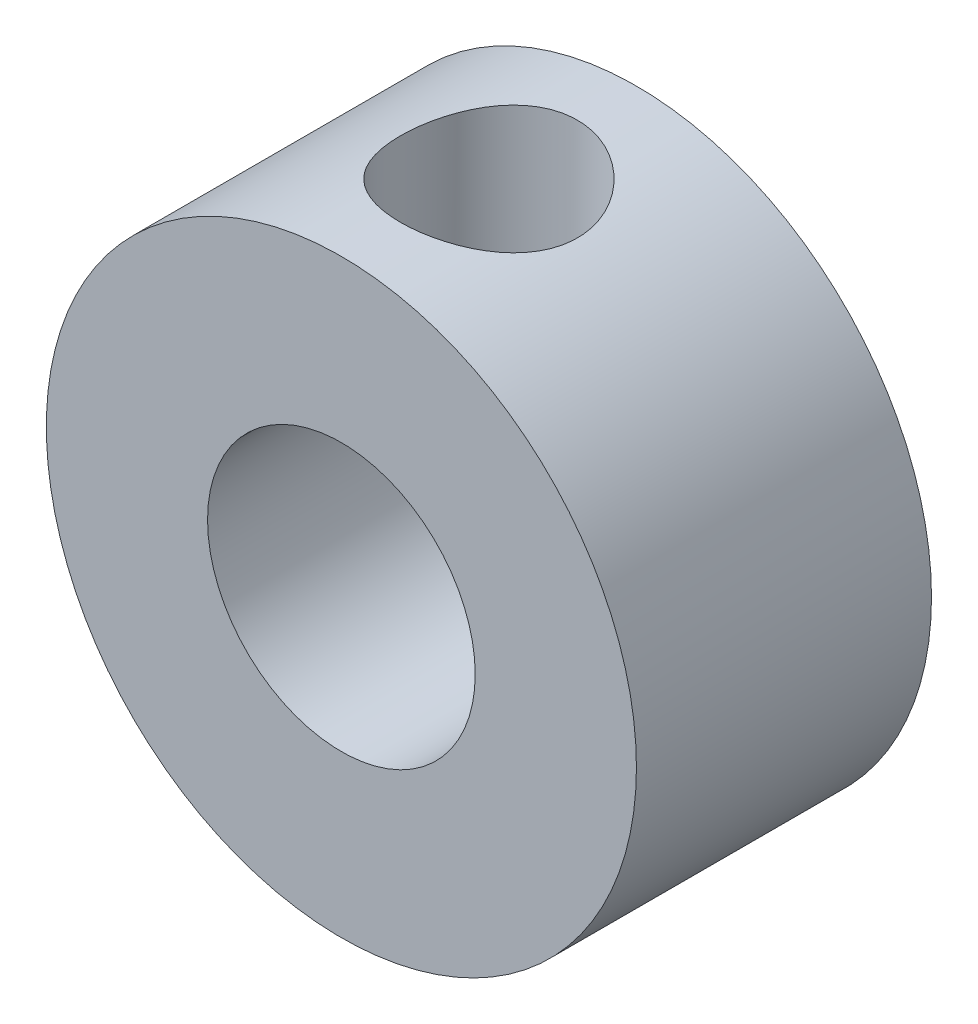
ISO-10303-21;
HEADER;
FILE_DESCRIPTION(('STEP AP214'),'2;1');
FILE_NAME('part.step','',(''),(''),'','','');
FILE_SCHEMA(('AUTOMOTIVE_DESIGN { 1 0 10303 214 1 1 1 1 }'));
ENDSEC;
DATA;
#1=APPLICATION_CONTEXT('core data for automotive mechanical design processes');
#2=APPLICATION_PROTOCOL_DEFINITION('international standard','automotive_design',2000,#1);
#3=PRODUCT_CONTEXT('',#1,'mechanical');
#4=PRODUCT('Part','Part','',(#3));
#5=PRODUCT_RELATED_PRODUCT_CATEGORY('part','',(#4));
#6=PRODUCT_DEFINITION_FORMATION('','',#4);
#7=PRODUCT_DEFINITION_CONTEXT('part definition',#1,'design');
#8=PRODUCT_DEFINITION('design','',#6,#7);
#9=PRODUCT_DEFINITION_SHAPE('','',#8);
#10=(LENGTH_UNIT() NAMED_UNIT(*) SI_UNIT(.MILLI.,.METRE.));
#11=(NAMED_UNIT(*) PLANE_ANGLE_UNIT() SI_UNIT($,.RADIAN.));
#12=(NAMED_UNIT(*) SI_UNIT($,.STERADIAN.) SOLID_ANGLE_UNIT());
#13=UNCERTAINTY_MEASURE_WITH_UNIT(LENGTH_MEASURE(1.E-05),#10,'distance_accuracy_value','');
#14=(GEOMETRIC_REPRESENTATION_CONTEXT(3) GLOBAL_UNCERTAINTY_ASSIGNED_CONTEXT((#13)) GLOBAL_UNIT_ASSIGNED_CONTEXT((#10,
#11,#12)) REPRESENTATION_CONTEXT('',''));
#15=CARTESIAN_POINT('',(0.,0.,0.));
#16=DIRECTION('',(0.,0.,1.));
#17=DIRECTION('',(1.,0.,0.));
#18=AXIS2_PLACEMENT_3D('',#15,#16,#17);
#19=CARTESIAN_POINT('',(0.,0.,7.));
#20=DIRECTION('',(0.,0.,1.));
#21=DIRECTION('',(1.,0.,0.));
#22=AXIS2_PLACEMENT_3D('',#19,#20,#21);
#23=PLANE('',#22);
#24=CARTESIAN_POINT('',(0.,0.,7.));
#25=DIRECTION('',(0.,0.,1.));
#26=DIRECTION('',(1.,0.,0.));
#27=AXIS2_PLACEMENT_3D('',#24,#25,#26);
#28=CIRCLE('',#27,7.);
#29=CARTESIAN_POINT('',(7.,0.,7.));
#30=VERTEX_POINT('',#29);
#31=EDGE_CURVE('E10',#30,#30,#28,.T.);
#32=ORIENTED_EDGE('',*,*,#31,.T.);
#33=EDGE_LOOP('',(#32));
#34=FACE_BOUND('',#33,.T.);
#35=CARTESIAN_POINT('',(0.,0.,7.));
#36=DIRECTION('',(0.,0.,1.));
#37=DIRECTION('',(1.,0.,0.));
#38=AXIS2_PLACEMENT_3D('',#35,#36,#37);
#39=CIRCLE('',#38,3.175);
#40=CARTESIAN_POINT('',(3.175,0.,7.));
#41=VERTEX_POINT('',#40);
#42=EDGE_CURVE('E47',#41,#41,#39,.T.);
#43=ORIENTED_EDGE('',*,*,#42,.F.);
#44=EDGE_LOOP('',(#43));
#45=FACE_BOUND('',#44,.T.);
#46=ADVANCED_FACE('F35',(#34,#45),#23,.T.);
#47=CARTESIAN_POINT('',(0.,0.,0.));
#48=DIRECTION('',(0.,0.,1.));
#49=DIRECTION('',(1.,0.,0.));
#50=AXIS2_PLACEMENT_3D('',#47,#48,#49);
#51=PLANE('',#50);
#52=CARTESIAN_POINT('',(0.,0.,0.));
#53=DIRECTION('',(0.,0.,1.));
#54=DIRECTION('',(1.,0.,0.));
#55=AXIS2_PLACEMENT_3D('',#52,#53,#54);
#56=CIRCLE('',#55,7.);
#57=CARTESIAN_POINT('',(7.,0.,0.));
#58=VERTEX_POINT('',#57);
#59=EDGE_CURVE('E40',#58,#58,#56,.T.);
#60=ORIENTED_EDGE('',*,*,#59,.F.);
#61=EDGE_LOOP('',(#60));
#62=FACE_BOUND('',#61,.T.);
#63=CARTESIAN_POINT('',(0.,0.,0.));
#64=DIRECTION('',(0.,0.,1.));
#65=DIRECTION('',(1.,0.,0.));
#66=AXIS2_PLACEMENT_3D('',#63,#64,#65);
#67=CIRCLE('',#66,3.175);
#68=CARTESIAN_POINT('',(3.175,0.,0.));
#69=VERTEX_POINT('',#68);
#70=EDGE_CURVE('E49',#69,#69,#67,.T.);
#71=ORIENTED_EDGE('',*,*,#70,.T.);
#72=EDGE_LOOP('',(#71));
#73=FACE_BOUND('',#72,.T.);
#74=ADVANCED_FACE('F76',(#62,#73),#51,.F.);
#75=CARTESIAN_POINT('',(0.,0.,7.));
#76=DIRECTION('',(0.,0.,-1.));
#77=DIRECTION('',(-1.,0.,0.));
#78=AXIS2_PLACEMENT_3D('',#75,#76,#77);
#79=CYLINDRICAL_SURFACE('',#78,7.);
#80=CARTESIAN_POINT('',(0.,7.,5.59999999999999));
#81=CARTESIAN_POINT('',(-0.115204057854619,6.9999990095077,5.59999860352115));
#82=CARTESIAN_POINT('',(-0.23042224569214,6.99712881971535,5.59048859092644));
#83=CARTESIAN_POINT('',(-0.457503375426832,6.98595947831167,5.55279010408905));
#84=CARTESIAN_POINT('',(-0.569365306175986,6.97765870745569,5.52459605876731));
#85=CARTESIAN_POINT('',(-0.786425790856335,6.95653773502571,5.45055557632562));
#86=CARTESIAN_POINT('',(-0.89163391015352,6.94372420350596,5.40473518253348));
#87=CARTESIAN_POINT('',(-1.09287385347438,6.91490952932704,5.29684946972182));
#88=CARTESIAN_POINT('',(-1.18890445445753,6.89890796268893,5.23478198964641));
#89=CARTESIAN_POINT('',(-1.37182051605724,6.86491032069884,5.09428638953826));
#90=CARTESIAN_POINT('',(-1.45840529974207,6.84687337119851,5.01547672375972));
#91=CARTESIAN_POINT('',(-1.61734889292653,6.81108167894619,4.84454707812574));
#92=CARTESIAN_POINT('',(-1.68970530858417,6.79332698414302,4.75242486302505));
#93=CARTESIAN_POINT('',(-1.8197205281319,6.75967759591281,4.55494094574734));
#94=CARTESIAN_POINT('',(-1.87701232631098,6.74383369329425,4.44932815461296));
#95=CARTESIAN_POINT('',(-1.97289952684664,6.71641068551644,4.22941504407759));
#96=CARTESIAN_POINT('',(-2.01149941887962,6.70483055638635,4.11511681850083));
#97=CARTESIAN_POINT('',(-2.06782287155712,6.68767219173808,3.88445362741736));
#98=CARTESIAN_POINT('',(-2.08610074728548,6.68193497054347,3.76823615859048));
#99=CARTESIAN_POINT('',(-2.1029922286054,6.67663905649674,3.53425358129653));
#100=CARTESIAN_POINT('',(-2.10161059865509,6.677078866648,3.41648885471728));
#101=CARTESIAN_POINT('',(-2.07965768079736,6.68394641694889,3.18726252794812));
#102=CARTESIAN_POINT('',(-2.05978087367759,6.69015744038797,3.07572684949287));
#103=CARTESIAN_POINT('',(-2.00252388597878,6.70751698720074,2.85765229921716));
#104=CARTESIAN_POINT('',(-1.96514197798297,6.71866599785291,2.75111392167594));
#105=CARTESIAN_POINT('',(-1.87342437315154,6.74481826304963,2.54435951047497));
#106=CARTESIAN_POINT('',(-1.81886343708499,6.75987222562333,2.44425008246264));
#107=CARTESIAN_POINT('',(-1.69449311624156,6.7921138180009,2.25437516918573));
#108=CARTESIAN_POINT('',(-1.62468003603623,6.80930196445788,2.16461219882071));
#109=CARTESIAN_POINT('',(-1.46833807071764,6.84475415817112,1.99403933293317));
#110=CARTESIAN_POINT('',(-1.38123287045376,6.86303316034697,1.91375987035847));
#111=CARTESIAN_POINT('',(-1.19456856303955,6.89797141688562,1.76882442231006));
#112=CARTESIAN_POINT('',(-1.09500867260524,6.91463056925774,1.70416942021981));
#113=CARTESIAN_POINT('',(-0.885297053679921,6.94460424097259,1.59199610854938));
#114=CARTESIAN_POINT('',(-0.775078849647127,6.9578956113564,1.5445954772502));
#115=CARTESIAN_POINT('',(-0.547743581844925,6.97946930565111,1.46916057386052));
#116=CARTESIAN_POINT('',(-0.430628452225412,6.98775302661799,1.44112090005452));
#117=CARTESIAN_POINT('',(-0.197333139735663,6.99815710500954,1.40608695094086));
#118=CARTESIAN_POINT('',(-0.0812701366416606,7.00048790584906,1.39837377987775));
#119=CARTESIAN_POINT('',(0.150499448152737,6.99934092538464,1.40219681799692));
#120=CARTESIAN_POINT('',(0.266206075367093,6.9958639194886,1.41373045751203));
#121=CARTESIAN_POINT('',(0.491265047433575,6.98362975782027,1.4551384555561));
#122=CARTESIAN_POINT('',(0.600701881659836,6.9749936171918,1.48459274261322));
#123=CARTESIAN_POINT('',(0.813056494536329,6.95344086978149,1.56050052588949));
#124=CARTESIAN_POINT('',(0.915973487835815,6.94052374849531,1.60695606545301));
#125=CARTESIAN_POINT('',(1.11501206524547,6.91137516091842,1.71675443167359));
#126=CARTESIAN_POINT('',(1.21092135667953,6.89507393161496,1.78046307732718));
#127=CARTESIAN_POINT('',(1.3909326311722,6.86102856270093,1.92251465567393));
#128=CARTESIAN_POINT('',(1.47503164529831,6.84328406203694,2.00086125664271));
#129=CARTESIAN_POINT('',(1.63220042371436,6.80754440616605,2.17334223171712));
#130=CARTESIAN_POINT('',(1.704758737241,6.78956355045859,2.26794662608056));
#131=CARTESIAN_POINT('',(1.83300593101018,6.75607121334564,2.46837911461882));
#132=CARTESIAN_POINT('',(1.88869525361275,6.74055966719185,2.57420691438104));
#133=CARTESIAN_POINT('',(1.9812428597802,6.71394065458417,2.79374548775703));
#134=CARTESIAN_POINT('',(2.01818885711814,6.70281272971451,2.90741666115297));
#135=CARTESIAN_POINT('',(2.07230423141214,6.68628232117816,3.13976315650233));
#136=CARTESIAN_POINT('',(2.08948038570493,6.68087787548571,3.25843674909625));
#137=CARTESIAN_POINT('',(2.1031077827895,6.67659961459091,3.49210612574379));
#138=CARTESIAN_POINT('',(2.1003927743112,6.67746306290276,3.60704911146919));
#139=CARTESIAN_POINT('',(2.07630507622027,6.68499161674532,3.83475974476086));
#140=CARTESIAN_POINT('',(2.05493313374585,6.69165648995131,3.94752747925272));
#141=CARTESIAN_POINT('',(1.9946764432608,6.7098606917247,4.16632355878434));
#142=CARTESIAN_POINT('',(1.95601245709973,6.72133846373454,4.27241820230217));
#143=CARTESIAN_POINT('',(1.86244109969503,6.74786390463686,4.47669941434901));
#144=CARTESIAN_POINT('',(1.80753061948005,6.76291225669556,4.5748844646982));
#145=CARTESIAN_POINT('',(1.68068269327122,6.79556746998737,4.76442836313677));
#146=CARTESIAN_POINT('',(1.60819786530197,6.81324756230006,4.85540826576426));
#147=CARTESIAN_POINT('',(1.44924408481688,6.84881848629347,5.02418349763132));
#148=CARTESIAN_POINT('',(1.36277150398828,6.8667093715328,5.10197539525494));
#149=CARTESIAN_POINT('',(1.17525206705656,6.90131311199101,5.24443277721295));
#150=CARTESIAN_POINT('',(1.07385304010685,6.91797623671995,5.30864802559766));
#151=CARTESIAN_POINT('',(0.861197923576932,6.94764952638087,5.41902923786565));
#152=CARTESIAN_POINT('',(0.749946474198531,6.9606613990348,5.46520364358431));
#153=CARTESIAN_POINT('',(0.533060797717391,6.98043044957033,5.53405338591384));
#154=CARTESIAN_POINT('',(0.428101746735925,6.98770838333498,5.55871634203654));
#155=CARTESIAN_POINT('',(0.215432273323089,6.99749322292286,5.5916889353382));
#156=CARTESIAN_POINT('',(0.107722313801395,7.00000092616635,5.60000130578674));
#157=CARTESIAN_POINT('',(0.,7.,5.59999999999999));
#158=B_SPLINE_CURVE_WITH_KNOTS('',3,(#80,#81,#82,#83,#84,#85,#86,#87,#88,#89,#90,#91,#92,#93,
#94,#95,#96,#97,#98,#99,#100,#101,#102,#103,#104,#105,#106,#107,#108,#109,#110,#111,#112,#113,
#114,#115,#116,#117,#118,#119,#120,#121,#122,#123,#124,#125,#126,#127,#128,#129,#130,#131,#132,
#133,#134,#135,#136,#137,#138,#139,#140,#141,#142,#143,#144,#145,#146,#147,#148,#149,#150,#151,
#152,#153,#154,#155,#156,#157),.UNSPECIFIED.,.T.,.F.,(4,2,2,2,2,2,2,2,2,2,2,2,2,2,2,2,2,2,2,2,2,
2,2,2,2,2,2,2,2,2,2,2,2,2,2,2,2,2,4),(0.,0.345216485057654,0.690535950784397,1.03534714682122,
1.38020423017778,1.73397844127468,2.08781212204086,2.44960073405752,2.81130240360512,
3.16287565099237,3.51436369646724,3.85316423376745,4.191998211212,4.53547397025966,
4.87903304221976,5.23693945667431,5.59486839143498,5.95519465634362,6.31542034940329,
6.66272333213961,7.00997994970455,7.34939445355255,7.68884976431217,8.03615827984069,
8.38355394800265,8.74356560451943,9.1035678195375,9.46186940931749,9.82004813244393,
10.1633021765698,10.5065424753262,10.8455205657019,11.1845635658073,11.5359569595828,
11.8874416486288,12.2492019462572,12.6107927623971,12.9336436870902,13.256440637348),.UNSPECIFIED.);
#159=CARTESIAN_POINT('',(0.,7.,5.59999999999999));
#160=VERTEX_POINT('',#159);
#161=EDGE_CURVE('E52',#160,#160,#158,.T.);
#162=ORIENTED_EDGE('',*,*,#161,.T.);
#163=EDGE_LOOP('',(#162));
#164=FACE_BOUND('',#163,.T.);
#165=ORIENTED_EDGE('',*,*,#31,.F.);
#166=EDGE_LOOP('',(#165));
#167=FACE_BOUND('',#166,.T.);
#168=ORIENTED_EDGE('',*,*,#59,.T.);
#169=EDGE_LOOP('',(#168));
#170=FACE_BOUND('',#169,.T.);
#171=ADVANCED_FACE('F37',(#164,#167,#170),#79,.T.);
#172=CARTESIAN_POINT('',(0.,0.,7.));
#173=DIRECTION('',(0.,0.,-1.));
#174=DIRECTION('',(-1.,0.,0.));
#175=AXIS2_PLACEMENT_3D('',#172,#173,#174);
#176=CYLINDRICAL_SURFACE('',#175,3.175);
#177=CARTESIAN_POINT('',(0.,3.175,5.59999999999999));
#178=CARTESIAN_POINT('',(-0.105666942130426,3.17499879238066,5.59999881633698));
#179=CARTESIAN_POINT('',(-0.211346115847993,3.16967839987641,5.59198010335207));
#180=CARTESIAN_POINT('',(-0.419344427397498,3.14892345986179,5.56039625922442));
#181=CARTESIAN_POINT('',(-0.521661564015984,3.1334829990558,5.53682203872947));
#182=CARTESIAN_POINT('',(-0.719617707417712,3.09401456245078,5.47556202926001));
#183=CARTESIAN_POINT('',(-0.815285589784497,3.0700269052664,5.43794245548979));
#184=CARTESIAN_POINT('',(-0.998573825891247,3.01539945808601,5.35018558134124));
#185=CARTESIAN_POINT('',(-1.08619309836802,2.9847587761664,5.30004660244025));
#186=CARTESIAN_POINT('',(-1.25923173404884,2.91621900120851,5.1840679538585));
#187=CARTESIAN_POINT('',(-1.34384357111781,2.87792584480847,5.11726128085943));
#188=CARTESIAN_POINT('',(-1.50142887264394,2.79895047709299,4.97214396359773));
#189=CARTESIAN_POINT('',(-1.5743855135827,2.7582649262721,4.89381699801052));
#190=CARTESIAN_POINT('',(-1.71813954616341,2.67146058338397,4.71377914361579));
#191=CARTESIAN_POINT('',(-1.78685204192319,2.62547636447798,4.61032545974334));
#192=CARTESIAN_POINT('',(-1.9058154589775,2.54044143355959,4.39072599387448));
#193=CARTESIAN_POINT('',(-1.95609831603507,2.50137878878846,4.27460262414157));
#194=CARTESIAN_POINT('',(-2.02424755374923,2.44630228402622,4.06635838781935));
#195=CARTESIAN_POINT('',(-2.04726861643446,2.42689233971892,3.97683130473318));
#196=CARTESIAN_POINT('',(-2.08137798489231,2.39770890744338,3.79406254955842));
#197=CARTESIAN_POINT('',(-2.09248636927385,2.3879192070618,3.70082740336898));
#198=CARTESIAN_POINT('',(-2.10207620639623,2.37948520868303,3.51281924460336));
#199=CARTESIAN_POINT('',(-2.10050874781255,2.38088408297222,3.41804168465236));
#200=CARTESIAN_POINT('',(-2.08474582825514,2.39469379980284,3.23032760554731));
#201=CARTESIAN_POINT('',(-2.07053969154422,2.40711395186023,3.13739271072815));
#202=CARTESIAN_POINT('',(-2.03124942430637,2.44034194019477,2.95964591856848));
#203=CARTESIAN_POINT('',(-2.00663624350463,2.46078416626386,2.87465715793661));
#204=CARTESIAN_POINT('',(-1.9476796060235,2.50770515984457,2.70993259426037));
#205=CARTESIAN_POINT('',(-1.91333295465698,2.53418590874164,2.63019852650176));
#206=CARTESIAN_POINT('',(-1.82795807127348,2.59663586977243,2.46112555257834));
#207=CARTESIAN_POINT('',(-1.77496269190463,2.63344167853042,2.37309151688966));
#208=CARTESIAN_POINT('',(-1.65722266378804,2.7090861604428,2.20614337400034));
#209=CARTESIAN_POINT('',(-1.59246359797599,2.74792728596602,2.12724065417472));
#210=CARTESIAN_POINT('',(-1.43723571753681,2.83272668612846,1.9639150942044));
#211=CARTESIAN_POINT('',(-1.34422190795681,2.87847853139562,1.88177694683623));
#212=CARTESIAN_POINT('',(-1.14338100125146,2.96398086708252,1.73416752066241));
#213=CARTESIAN_POINT('',(-1.03556838860622,3.00373714683909,1.66868012136974));
#214=CARTESIAN_POINT('',(-0.829762877124378,3.06615460655169,1.56818755334705));
#215=CARTESIAN_POINT('',(-0.734016610663285,3.09064048858772,1.52971931393564));
#216=CARTESIAN_POINT('',(-0.536263339055799,3.13100631058106,1.46698343436526));
#217=CARTESIAN_POINT('',(-0.43426166442679,3.14689346750517,1.44270388417668));
#218=CARTESIAN_POINT('',(-0.22626932227534,3.16865868058766,1.40956192087642));
#219=CARTESIAN_POINT('',(-0.120264042636326,3.17449552273789,1.40076298698492));
#220=CARTESIAN_POINT('',(0.0919087286426109,3.17544116801929,1.39933273118543));
#221=CARTESIAN_POINT('',(0.198076213514524,3.17055040716814,1.40670075218021));
#222=CARTESIAN_POINT('',(0.40010135109505,3.15121594930354,1.43610894878198));
#223=CARTESIAN_POINT('',(0.496174185761133,3.13743160536117,1.45713707743452));
#224=CARTESIAN_POINT('',(0.683120819607955,3.10210069226176,1.5118254267518));
#225=CARTESIAN_POINT('',(0.773993782228582,3.08055287815659,1.54548767345666));
#226=CARTESIAN_POINT('',(0.954414222615161,3.02969586045413,1.62663515464134));
#227=CARTESIAN_POINT('',(1.04351019483534,2.99998033783804,1.67486309256218));
#228=CARTESIAN_POINT('',(1.21267110339811,2.93568693450661,1.78258895896698));
#229=CARTESIAN_POINT('',(1.29273010759402,2.90110589298291,1.84209422237839));
#230=CARTESIAN_POINT('',(1.45485427857817,2.82370411190104,1.98126841035975));
#231=CARTESIAN_POINT('',(1.53525121968251,2.78044324398821,2.06263690066796));
#232=CARTESIAN_POINT('',(1.68196404983882,2.69422806223057,2.23745089344838));
#233=CARTESIAN_POINT('',(1.74827143634398,2.65127394852365,2.33090363393555));
#234=CARTESIAN_POINT('',(1.85987603300246,2.57403165600421,2.51935331261141));
#235=CARTESIAN_POINT('',(1.90658273230418,2.53930723796152,2.61333222372944));
#236=CARTESIAN_POINT('',(1.98600111455969,2.47769295814784,2.80939445059154));
#237=CARTESIAN_POINT('',(2.01873806037579,2.45078898225456,2.91146273761998));
#238=CARTESIAN_POINT('',(2.06423995948364,2.41252443823591,3.10383871434245));
#239=CARTESIAN_POINT('',(2.07945818250833,2.39929602959229,3.19318517750648));
#240=CARTESIAN_POINT('',(2.09817929992642,2.38294664954448,3.37398101921913));
#241=CARTESIAN_POINT('',(2.10169374331041,2.37981571430804,3.46542823499832));
#242=CARTESIAN_POINT('',(2.09678111624576,2.38414365291566,3.64774797627478));
#243=CARTESIAN_POINT('',(2.08835224852311,2.39160412059387,3.73862041321003));
#244=CARTESIAN_POINT('',(2.06011143801102,2.41596792853011,3.9173133484233));
#245=CARTESIAN_POINT('',(2.04028443088172,2.43288376464598,4.00512964434074));
#246=CARTESIAN_POINT('',(1.98333854869819,2.47965448823685,4.19947047068255));
#247=CARTESIAN_POINT('',(1.94296000819942,2.51179052649757,4.3044808996606));
#248=CARTESIAN_POINT('',(1.84730022891333,2.58295454170277,4.5049188478443));
#249=CARTESIAN_POINT('',(1.7919982390153,2.62199208895612,4.60033276754406));
#250=CARTESIAN_POINT('',(1.6668039433521,2.70334256622501,4.78224793966243));
#251=CARTESIAN_POINT('',(1.59667440241158,2.74570068507061,4.86856512088433));
#252=CARTESIAN_POINT('',(1.44336595597988,2.8293019716689,5.02939185253385));
#253=CARTESIAN_POINT('',(1.36018324464809,2.8705448101211,5.10389794649214));
#254=CARTESIAN_POINT('',(1.17002605265986,2.95360307997063,5.24845205700241));
#255=CARTESIAN_POINT('',(1.06136510247066,2.99479905858859,5.31666868336273));
#256=CARTESIAN_POINT('',(0.83067724353135,3.06677466860718,5.43302144262387));
#257=CARTESIAN_POINT('',(0.708674958938155,3.09757307518336,5.48119380697189));
#258=CARTESIAN_POINT('',(0.488509208708161,3.13864076246564,5.54471299684124));
#259=CARTESIAN_POINT('',(0.392462650724865,3.15217322497122,5.56535108465923));
#260=CARTESIAN_POINT('',(0.197613207817714,3.1703508363311,5.59299119328946));
#261=CARTESIAN_POINT('',(0.0988119519346795,3.17500112927678,5.60000110687458));
#262=CARTESIAN_POINT('',(0.,3.175,5.59999999999999));
#263=B_SPLINE_CURVE_WITH_KNOTS('',3,(#177,#178,#179,#180,#181,#182,#183,#184,#185,#186,#187,
#188,#189,#190,#191,#192,#193,#194,#195,#196,#197,#198,#199,#200,#201,#202,#203,#204,#205,#206,
#207,#208,#209,#210,#211,#212,#213,#214,#215,#216,#217,#218,#219,#220,#221,#222,#223,#224,#225,
#226,#227,#228,#229,#230,#231,#232,#233,#234,#235,#236,#237,#238,#239,#240,#241,#242,#243,#244,
#245,#246,#247,#248,#249,#250,#251,#252,#253,#254,#255,#256,#257,#258,#259,#260,#261,#262),
.UNSPECIFIED.,.T.,.F.,(4,2,2,2,2,2,2,2,2,2,2,2,2,2,2,2,2,2,2,2,2,2,2,2,2,2,2,2,2,2,2,2,2,2,2,2,
2,2,2,2,2,2,4),(0.,0.316601666536632,0.633388492918793,0.948700344549727,1.26405449392058,
1.60598200214707,1.94839868610048,2.34385441162991,2.73862159589677,3.02085790117188,
3.30261775084931,3.58546532337945,3.86855204088163,4.14000701923396,4.41155119702659,
4.73784601903464,5.0645434654013,5.45942361602498,5.8539199935312,6.17073663687738,
6.48728695994319,6.8051323180109,7.12296475766327,7.41958488746378,7.71625260438027,
8.03177980280992,8.34751293318775,8.71294998554411,9.078606943816,9.40900123044351,
9.73879547457539,10.0123704239286,10.2856753363967,10.5590213811758,10.8327295267756,
11.1818713838919,11.531501248183,11.8872176233822,12.2430379062016,12.6450055265005,
13.0462433714218,13.3424775778427,13.6385401687109),.UNSPECIFIED.);
#264=CARTESIAN_POINT('',(0.,3.175,5.59999999999999));
#265=VERTEX_POINT('',#264);
#266=EDGE_CURVE('E60',#265,#265,#263,.T.);
#267=ORIENTED_EDGE('',*,*,#266,.F.);
#268=EDGE_LOOP('',(#267));
#269=FACE_BOUND('',#268,.T.);
#270=ORIENTED_EDGE('',*,*,#42,.T.);
#271=EDGE_LOOP('',(#270));
#272=FACE_BOUND('',#271,.T.);
#273=ORIENTED_EDGE('',*,*,#70,.F.);
#274=EDGE_LOOP('',(#273));
#275=FACE_BOUND('',#274,.T.);
#276=ADVANCED_FACE('F67',(#269,#272,#275),#176,.F.);
#277=CARTESIAN_POINT('',(0.,7.,3.5));
#278=DIRECTION('',(0.,1.,0.));
#279=DIRECTION('',(0.,0.,1.));
#280=AXIS2_PLACEMENT_3D('',#277,#278,#279);
#281=CYLINDRICAL_SURFACE('',#280,2.09999999999999);
#282=ORIENTED_EDGE('',*,*,#266,.T.);
#283=EDGE_LOOP('',(#282));
#284=FACE_BOUND('',#283,.T.);
#285=ORIENTED_EDGE('',*,*,#161,.F.);
#286=EDGE_LOOP('',(#285));
#287=FACE_BOUND('',#286,.T.);
#288=ADVANCED_FACE('F64',(#284,#287),#281,.F.);
#289=CLOSED_SHELL('',(#46,#74,#171,#276,#288));
#290=MANIFOLD_SOLID_BREP('B2',#289);
#291=ADVANCED_BREP_SHAPE_REPRESENTATION('',(#18,#290),#14);
#292=SHAPE_DEFINITION_REPRESENTATION(#9,#291);
ENDSEC;
END-ISO-10303-21;
